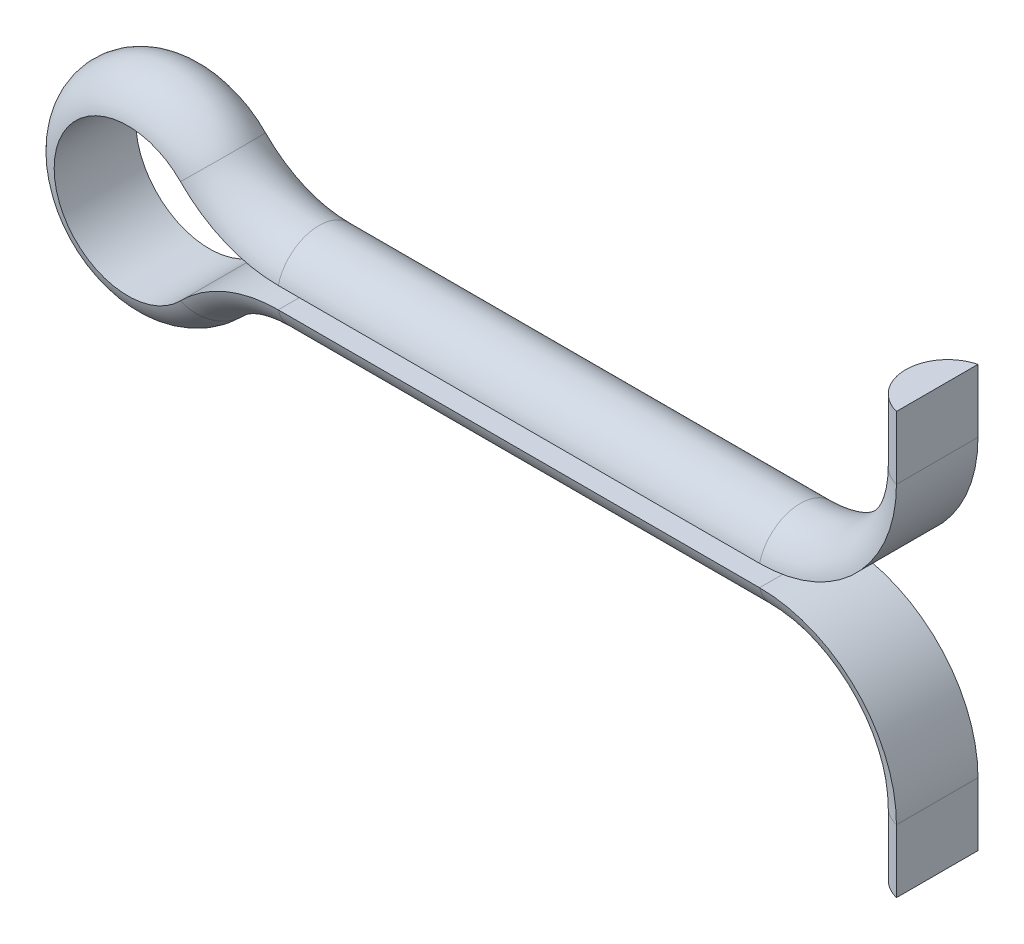
ISO-10303-21;
HEADER;
FILE_DESCRIPTION(('STEP AP214'),'2;1');
FILE_NAME('part.step','',(''),(''),'','','');
FILE_SCHEMA(('AUTOMOTIVE_DESIGN { 1 0 10303 214 1 1 1 1 }'));
ENDSEC;
DATA;
#1=APPLICATION_CONTEXT('core data for automotive mechanical design processes');
#2=APPLICATION_PROTOCOL_DEFINITION('international standard','automotive_design',2000,#1);
#3=PRODUCT_CONTEXT('',#1,'mechanical');
#4=PRODUCT('Part','Part','',(#3));
#5=PRODUCT_RELATED_PRODUCT_CATEGORY('part','',(#4));
#6=PRODUCT_DEFINITION_FORMATION('','',#4);
#7=PRODUCT_DEFINITION_CONTEXT('part definition',#1,'design');
#8=PRODUCT_DEFINITION('design','',#6,#7);
#9=PRODUCT_DEFINITION_SHAPE('','',#8);
#10=(LENGTH_UNIT() NAMED_UNIT(*) SI_UNIT(.MILLI.,.METRE.));
#11=(NAMED_UNIT(*) PLANE_ANGLE_UNIT() SI_UNIT($,.RADIAN.));
#12=(NAMED_UNIT(*) SI_UNIT($,.STERADIAN.) SOLID_ANGLE_UNIT());
#13=UNCERTAINTY_MEASURE_WITH_UNIT(LENGTH_MEASURE(1.E-05),#10,'distance_accuracy_value','');
#14=(GEOMETRIC_REPRESENTATION_CONTEXT(3) GLOBAL_UNCERTAINTY_ASSIGNED_CONTEXT((#13)) GLOBAL_UNIT_ASSIGNED_CONTEXT((#10,
#11,#12)) REPRESENTATION_CONTEXT('',''));
#15=CARTESIAN_POINT('',(0.,0.,0.));
#16=DIRECTION('',(0.,0.,1.));
#17=DIRECTION('',(1.,0.,0.));
#18=AXIS2_PLACEMENT_3D('',#15,#16,#17);
#19=CARTESIAN_POINT('',(37.,10.,0.));
#20=DIRECTION('',(0.,-1.,0.));
#21=DIRECTION('',(0.,0.,-1.));
#22=AXIS2_PLACEMENT_3D('',#19,#20,#21);
#23=PLANE('',#22);
#24=CARTESIAN_POINT('',(37.,10.,0.));
#25=DIRECTION('',(0.,-1.,0.));
#26=DIRECTION('',(0.,0.,-1.));
#27=AXIS2_PLACEMENT_3D('',#24,#25,#26);
#28=CIRCLE('',#27,2.);
#29=CARTESIAN_POINT('',(36.5,10.,1.93649167310371));
#30=VERTEX_POINT('',#29);
#31=CARTESIAN_POINT('',(36.5,10.,-1.93649167310371));
#32=VERTEX_POINT('',#31);
#33=EDGE_CURVE('E105',#30,#32,#28,.T.);
#34=ORIENTED_EDGE('',*,*,#33,.F.);
#35=DIRECTION('',(0.,0.,1.));
#36=VECTOR('',#35,1.);
#37=CARTESIAN_POINT('',(36.5,10.,-1.93649167310371));
#38=LINE('',#37,#36);
#39=EDGE_CURVE('E107',#32,#30,#38,.T.);
#40=ORIENTED_EDGE('',*,*,#39,.F.);
#41=EDGE_LOOP('',(#34,#40));
#42=FACE_BOUND('',#41,.T.);
#43=ADVANCED_FACE('F35',(#42),#23,.F.);
#44=CARTESIAN_POINT('',(37.,-9.99999999999991,0.));
#45=DIRECTION('',(0.,-1.,0.));
#46=DIRECTION('',(0.,0.,-1.));
#47=AXIS2_PLACEMENT_3D('',#44,#45,#46);
#48=PLANE('',#47);
#49=CARTESIAN_POINT('',(37.,-9.99999999999991,0.));
#50=DIRECTION('',(0.,-1.,0.));
#51=DIRECTION('',(0.,0.,-1.));
#52=AXIS2_PLACEMENT_3D('',#49,#50,#51);
#53=CIRCLE('',#52,2.);
#54=CARTESIAN_POINT('',(36.5,-9.99999999999991,1.93649167310371));
#55=VERTEX_POINT('',#54);
#56=CARTESIAN_POINT('',(36.5,-9.99999999999991,-1.93649167310371));
#57=VERTEX_POINT('',#56);
#58=EDGE_CURVE('E47',#55,#57,#53,.T.);
#59=ORIENTED_EDGE('',*,*,#58,.T.);
#60=DIRECTION('',(0.,0.,1.));
#61=VECTOR('',#60,1.);
#62=CARTESIAN_POINT('',(36.5,-9.99999999999991,-1.93649167310371));
#63=LINE('',#62,#61);
#64=EDGE_CURVE('E11',#57,#55,#63,.T.);
#65=ORIENTED_EDGE('',*,*,#64,.T.);
#66=EDGE_LOOP('',(#59,#65));
#67=FACE_BOUND('',#66,.T.);
#68=ADVANCED_FACE('F283',(#67),#48,.T.);
#69=CARTESIAN_POINT('',(37.,10.,0.));
#70=DIRECTION('',(0.,-1.,0.));
#71=DIRECTION('',(0.,0.,-1.));
#72=AXIS2_PLACEMENT_3D('',#69,#70,#71);
#73=CYLINDRICAL_SURFACE('',#72,2.);
#74=DIRECTION('',(0.,-1.,0.));
#75=VECTOR('',#74,1.);
#76=CARTESIAN_POINT('',(36.5,10.,-1.93649167310371));
#77=LINE('',#76,#75);
#78=CARTESIAN_POINT('',(36.5,7.00000000000001,-1.93649167310371));
#79=VERTEX_POINT('',#78);
#80=EDGE_CURVE('E118',#32,#79,#77,.T.);
#81=ORIENTED_EDGE('',*,*,#80,.T.);
#82=CARTESIAN_POINT('',(37.,7.00000000000001,0.));
#83=DIRECTION('',(0.,-1.,0.));
#84=DIRECTION('',(0.,0.,-1.));
#85=AXIS2_PLACEMENT_3D('',#82,#83,#84);
#86=CIRCLE('',#85,2.);
#87=CARTESIAN_POINT('',(36.5,7.00000000000001,1.93649167310371));
#88=VERTEX_POINT('',#87);
#89=EDGE_CURVE('E123',#88,#79,#86,.T.);
#90=ORIENTED_EDGE('',*,*,#89,.F.);
#91=DIRECTION('',(0.,-1.,0.));
#92=VECTOR('',#91,1.);
#93=CARTESIAN_POINT('',(36.5,10.,1.93649167310371));
#94=LINE('',#93,#92);
#95=EDGE_CURVE('E117',#30,#88,#94,.T.);
#96=ORIENTED_EDGE('',*,*,#95,.F.);
#97=ORIENTED_EDGE('',*,*,#33,.T.);
#98=EDGE_LOOP('',(#81,#90,#96,#97));
#99=FACE_BOUND('',#98,.T.);
#100=ADVANCED_FACE('F121',(#99),#73,.T.);
#101=CARTESIAN_POINT('',(36.5,10.,-1.93649167310371));
#102=DIRECTION('',(1.,0.,0.));
#103=DIRECTION('',(0.,0.,-1.));
#104=AXIS2_PLACEMENT_3D('',#101,#102,#103);
#105=PLANE('',#104);
#106=DIRECTION('',(0.,0.,1.));
#107=VECTOR('',#106,1.);
#108=CARTESIAN_POINT('',(36.5,7.00000000000001,-1.93649167310371));
#109=LINE('',#108,#107);
#110=EDGE_CURVE('E138',#79,#88,#109,.T.);
#111=ORIENTED_EDGE('',*,*,#110,.F.);
#112=ORIENTED_EDGE('',*,*,#80,.F.);
#113=ORIENTED_EDGE('',*,*,#39,.T.);
#114=ORIENTED_EDGE('',*,*,#95,.T.);
#115=EDGE_LOOP('',(#111,#112,#113,#114));
#116=FACE_BOUND('',#115,.T.);
#117=ADVANCED_FACE('F116',(#116),#105,.T.);
#118=CARTESIAN_POINT('',(30.,7.,0.));
#119=DIRECTION('',(0.,0.,-1.));
#120=DIRECTION('',(-1.,0.,0.));
#121=AXIS2_PLACEMENT_3D('',#118,#119,#120);
#122=TOROIDAL_SURFACE('',#121,7.,2.);
#123=CARTESIAN_POINT('',(30.,7.,-1.93649167310371));
#124=DIRECTION('',(0.,0.,-1.));
#125=DIRECTION('',(1.,0.,0.));
#126=AXIS2_PLACEMENT_3D('',#123,#124,#125);
#127=CIRCLE('',#126,6.5);
#128=CARTESIAN_POINT('',(30.,0.500000000000002,-1.93649167310371));
#129=VERTEX_POINT('',#128);
#130=EDGE_CURVE('E131',#79,#129,#127,.T.);
#131=ORIENTED_EDGE('',*,*,#130,.T.);
#132=CARTESIAN_POINT('',(30.,0.,0.));
#133=DIRECTION('',(-1.,0.,0.));
#134=DIRECTION('',(0.,0.,-1.));
#135=AXIS2_PLACEMENT_3D('',#132,#133,#134);
#136=CIRCLE('',#135,2.);
#137=CARTESIAN_POINT('',(30.,0.500000000000002,1.93649167310371));
#138=VERTEX_POINT('',#137);
#139=EDGE_CURVE('E128',#138,#129,#136,.T.);
#140=ORIENTED_EDGE('',*,*,#139,.F.);
#141=CARTESIAN_POINT('',(30.,7.,1.93649167310371));
#142=DIRECTION('',(0.,0.,-1.));
#143=DIRECTION('',(1.,0.,0.));
#144=AXIS2_PLACEMENT_3D('',#141,#142,#143);
#145=CIRCLE('',#144,6.5);
#146=EDGE_CURVE('E132',#88,#138,#145,.T.);
#147=ORIENTED_EDGE('',*,*,#146,.F.);
#148=ORIENTED_EDGE('',*,*,#89,.T.);
#149=EDGE_LOOP('',(#131,#140,#147,#148));
#150=FACE_BOUND('',#149,.T.);
#151=ADVANCED_FACE('F262',(#150),#122,.T.);
#152=CARTESIAN_POINT('',(30.,7.,0.));
#153=DIRECTION('',(0.,0.,-1.));
#154=DIRECTION('',(-1.,0.,0.));
#155=AXIS2_PLACEMENT_3D('',#152,#153,#154);
#156=CYLINDRICAL_SURFACE('',#155,6.5);
#157=DIRECTION('',(0.,0.,1.));
#158=VECTOR('',#157,1.);
#159=CARTESIAN_POINT('',(30.,0.500000000000007,-1.93649167310371));
#160=LINE('',#159,#158);
#161=EDGE_CURVE('E135',#129,#138,#160,.T.);
#162=ORIENTED_EDGE('',*,*,#161,.F.);
#163=ORIENTED_EDGE('',*,*,#130,.F.);
#164=ORIENTED_EDGE('',*,*,#110,.T.);
#165=ORIENTED_EDGE('',*,*,#146,.T.);
#166=EDGE_LOOP('',(#162,#163,#164,#165));
#167=FACE_BOUND('',#166,.T.);
#168=ADVANCED_FACE('F263',(#167),#156,.T.);
#169=CARTESIAN_POINT('',(30.,0.,0.));
#170=DIRECTION('',(-1.,0.,0.));
#171=DIRECTION('',(0.,-1.,0.));
#172=AXIS2_PLACEMENT_3D('',#169,#170,#171);
#173=CYLINDRICAL_SURFACE('',#172,2.);
#174=DIRECTION('',(-1.,0.,0.));
#175=VECTOR('',#174,1.);
#176=CARTESIAN_POINT('',(30.,0.500000000000007,-1.93649167310371));
#177=LINE('',#176,#175);
#178=CARTESIAN_POINT('',(7.14142842854285,0.499999999999999,-1.93649167310371));
#179=VERTEX_POINT('',#178);
#180=EDGE_CURVE('E142',#129,#179,#177,.T.);
#181=ORIENTED_EDGE('',*,*,#180,.T.);
#182=CARTESIAN_POINT('',(7.14142842854285,0.,0.));
#183=DIRECTION('',(-1.,0.,0.));
#184=DIRECTION('',(0.,0.,-1.));
#185=AXIS2_PLACEMENT_3D('',#182,#183,#184);
#186=CIRCLE('',#185,2.);
#187=CARTESIAN_POINT('',(7.14142842854285,0.499999999999999,1.93649167310371));
#188=VERTEX_POINT('',#187);
#189=EDGE_CURVE('E139',#188,#179,#186,.T.);
#190=ORIENTED_EDGE('',*,*,#189,.F.);
#191=DIRECTION('',(-1.,0.,0.));
#192=VECTOR('',#191,1.);
#193=CARTESIAN_POINT('',(30.,0.500000000000007,1.93649167310371));
#194=LINE('',#193,#192);
#195=EDGE_CURVE('E143',#138,#188,#194,.T.);
#196=ORIENTED_EDGE('',*,*,#195,.F.);
#197=ORIENTED_EDGE('',*,*,#139,.T.);
#198=EDGE_LOOP('',(#181,#190,#196,#197));
#199=FACE_BOUND('',#198,.T.);
#200=ADVANCED_FACE('F256',(#199),#173,.T.);
#201=CARTESIAN_POINT('',(30.,0.500000000000007,-1.93649167310371));
#202=DIRECTION('',(0.,-1.,0.));
#203=DIRECTION('',(1.,0.,0.));
#204=AXIS2_PLACEMENT_3D('',#201,#202,#203);
#205=PLANE('',#204);
#206=DIRECTION('',(0.,0.,1.));
#207=VECTOR('',#206,1.);
#208=CARTESIAN_POINT('',(7.14142842854285,0.5,-1.93649167310371));
#209=LINE('',#208,#207);
#210=EDGE_CURVE('E146',#179,#188,#209,.T.);
#211=ORIENTED_EDGE('',*,*,#210,.F.);
#212=ORIENTED_EDGE('',*,*,#180,.F.);
#213=ORIENTED_EDGE('',*,*,#161,.T.);
#214=ORIENTED_EDGE('',*,*,#195,.T.);
#215=EDGE_LOOP('',(#211,#212,#213,#214));
#216=FACE_BOUND('',#215,.T.);
#217=ADVANCED_FACE('F257',(#216),#205,.T.);
#218=CARTESIAN_POINT('',(7.14142842854285,7.,0.));
#219=DIRECTION('',(0.,0.,-1.));
#220=DIRECTION('',(-1.,0.,0.));
#221=AXIS2_PLACEMENT_3D('',#218,#219,#220);
#222=TOROIDAL_SURFACE('',#221,7.,2.);
#223=CARTESIAN_POINT('',(7.14142842854285,7.,-1.93649167310371));
#224=DIRECTION('',(0.,0.,-1.));
#225=DIRECTION('',(0.,-1.,0.));
#226=AXIS2_PLACEMENT_3D('',#223,#224,#225);
#227=CIRCLE('',#226,6.5);
#228=CARTESIAN_POINT('',(2.49949994999,2.45,-1.93649167310371));
#229=VERTEX_POINT('',#228);
#230=EDGE_CURVE('E152',#179,#229,#227,.T.);
#231=ORIENTED_EDGE('',*,*,#230,.T.);
#232=CARTESIAN_POINT('',(2.14242852856286,2.1,0.));
#233=DIRECTION('',(-0.7,0.714142842854285,0.));
#234=DIRECTION('',(0.,0.,-1.));
#235=AXIS2_PLACEMENT_3D('',#232,#233,#234);
#236=CIRCLE('',#235,2.);
#237=CARTESIAN_POINT('',(2.49949994999,2.45,1.93649167310371));
#238=VERTEX_POINT('',#237);
#239=EDGE_CURVE('E149',#238,#229,#236,.T.);
#240=ORIENTED_EDGE('',*,*,#239,.F.);
#241=CARTESIAN_POINT('',(7.14142842854285,7.,1.93649167310371));
#242=DIRECTION('',(0.,0.,-1.));
#243=DIRECTION('',(0.,-1.,0.));
#244=AXIS2_PLACEMENT_3D('',#241,#242,#243);
#245=CIRCLE('',#244,6.5);
#246=EDGE_CURVE('E153',#188,#238,#245,.T.);
#247=ORIENTED_EDGE('',*,*,#246,.F.);
#248=ORIENTED_EDGE('',*,*,#189,.T.);
#249=EDGE_LOOP('',(#231,#240,#247,#248));
#250=FACE_BOUND('',#249,.T.);
#251=ADVANCED_FACE('F250',(#250),#222,.T.);
#252=CARTESIAN_POINT('',(7.14142842854285,7.,0.));
#253=DIRECTION('',(0.,0.,-1.));
#254=DIRECTION('',(-1.,0.,0.));
#255=AXIS2_PLACEMENT_3D('',#252,#253,#254);
#256=CYLINDRICAL_SURFACE('',#255,6.5);
#257=DIRECTION('',(0.,0.,1.));
#258=VECTOR('',#257,1.);
#259=CARTESIAN_POINT('',(2.49949994999,2.45,-1.93649167310371));
#260=LINE('',#259,#258);
#261=EDGE_CURVE('E156',#229,#238,#260,.T.);
#262=ORIENTED_EDGE('',*,*,#261,.F.);
#263=ORIENTED_EDGE('',*,*,#230,.F.);
#264=ORIENTED_EDGE('',*,*,#210,.T.);
#265=ORIENTED_EDGE('',*,*,#246,.T.);
#266=EDGE_LOOP('',(#262,#263,#264,#265));
#267=FACE_BOUND('',#266,.T.);
#268=ADVANCED_FACE('F251',(#267),#256,.T.);
#269=CARTESIAN_POINT('',(0.,0.,0.));
#270=DIRECTION('',(0.,0.,1.));
#271=DIRECTION('',(1.,0.,0.));
#272=AXIS2_PLACEMENT_3D('',#269,#270,#271);
#273=TOROIDAL_SURFACE('',#272,2.99999999999999,2.);
#274=CARTESIAN_POINT('',(0.,0.,-1.93649167310371));
#275=DIRECTION('',(0.,0.,1.));
#276=DIRECTION('',(0.714142842854286,0.699999999999999,0.));
#277=AXIS2_PLACEMENT_3D('',#274,#275,#276);
#278=CIRCLE('',#277,3.5);
#279=CARTESIAN_POINT('',(2.49949994998999,-2.45,-1.93649167310371));
#280=VERTEX_POINT('',#279);
#281=EDGE_CURVE('E162',#229,#280,#278,.T.);
#282=ORIENTED_EDGE('',*,*,#281,.T.);
#283=CARTESIAN_POINT('',(2.14242852856286,-2.1,0.));
#284=DIRECTION('',(0.7,0.714142842854285,0.));
#285=DIRECTION('',(0.,0.,-1.));
#286=AXIS2_PLACEMENT_3D('',#283,#284,#285);
#287=CIRCLE('',#286,2.);
#288=CARTESIAN_POINT('',(2.49949994998999,-2.45,1.93649167310371));
#289=VERTEX_POINT('',#288);
#290=EDGE_CURVE('E159',#289,#280,#287,.T.);
#291=ORIENTED_EDGE('',*,*,#290,.F.);
#292=CARTESIAN_POINT('',(0.,0.,1.93649167310371));
#293=DIRECTION('',(0.,0.,1.));
#294=DIRECTION('',(0.714142842854286,0.699999999999999,0.));
#295=AXIS2_PLACEMENT_3D('',#292,#293,#294);
#296=CIRCLE('',#295,3.5);
#297=EDGE_CURVE('E163',#238,#289,#296,.T.);
#298=ORIENTED_EDGE('',*,*,#297,.F.);
#299=ORIENTED_EDGE('',*,*,#239,.T.);
#300=EDGE_LOOP('',(#282,#291,#298,#299));
#301=FACE_BOUND('',#300,.T.);
#302=ADVANCED_FACE('F244',(#301),#273,.T.);
#303=CARTESIAN_POINT('',(0.,0.,0.));
#304=DIRECTION('',(0.,0.,1.));
#305=DIRECTION('',(1.,0.,0.));
#306=AXIS2_PLACEMENT_3D('',#303,#304,#305);
#307=CYLINDRICAL_SURFACE('',#306,3.5);
#308=DIRECTION('',(0.,0.,1.));
#309=VECTOR('',#308,1.);
#310=CARTESIAN_POINT('',(2.49949994999,-2.45,-1.93649167310371));
#311=LINE('',#310,#309);
#312=EDGE_CURVE('E166',#280,#289,#311,.T.);
#313=ORIENTED_EDGE('',*,*,#312,.F.);
#314=ORIENTED_EDGE('',*,*,#281,.F.);
#315=ORIENTED_EDGE('',*,*,#261,.T.);
#316=ORIENTED_EDGE('',*,*,#297,.T.);
#317=EDGE_LOOP('',(#313,#314,#315,#316));
#318=FACE_BOUND('',#317,.T.);
#319=ADVANCED_FACE('F245',(#318),#307,.F.);
#320=CARTESIAN_POINT('',(7.14142842854285,-7.,0.));
#321=DIRECTION('',(0.,0.,-1.));
#322=DIRECTION('',(-1.,0.,0.));
#323=AXIS2_PLACEMENT_3D('',#320,#321,#322);
#324=TOROIDAL_SURFACE('',#323,7.,2.);
#325=CARTESIAN_POINT('',(7.14142842854285,-7.,-1.93649167310371));
#326=DIRECTION('',(0.,0.,-1.));
#327=DIRECTION('',(-0.714142842854285,0.7,0.));
#328=AXIS2_PLACEMENT_3D('',#325,#326,#327);
#329=CIRCLE('',#328,6.5);
#330=CARTESIAN_POINT('',(7.14142842854285,-0.500000000000001,-1.93649167310371));
#331=VERTEX_POINT('',#330);
#332=EDGE_CURVE('E172',#280,#331,#329,.T.);
#333=ORIENTED_EDGE('',*,*,#332,.T.);
#334=CARTESIAN_POINT('',(7.14142842854285,0.,0.));
#335=DIRECTION('',(1.,0.,0.));
#336=DIRECTION('',(0.,0.,-1.));
#337=AXIS2_PLACEMENT_3D('',#334,#335,#336);
#338=CIRCLE('',#337,2.);
#339=CARTESIAN_POINT('',(7.14142842854285,-0.500000000000001,1.93649167310371));
#340=VERTEX_POINT('',#339);
#341=EDGE_CURVE('E169',#340,#331,#338,.T.);
#342=ORIENTED_EDGE('',*,*,#341,.F.);
#343=CARTESIAN_POINT('',(7.14142842854285,-7.,1.93649167310371));
#344=DIRECTION('',(0.,0.,-1.));
#345=DIRECTION('',(-0.714142842854285,0.7,0.));
#346=AXIS2_PLACEMENT_3D('',#343,#344,#345);
#347=CIRCLE('',#346,6.5);
#348=EDGE_CURVE('E173',#289,#340,#347,.T.);
#349=ORIENTED_EDGE('',*,*,#348,.F.);
#350=ORIENTED_EDGE('',*,*,#290,.T.);
#351=EDGE_LOOP('',(#333,#342,#349,#350));
#352=FACE_BOUND('',#351,.T.);
#353=ADVANCED_FACE('F238',(#352),#324,.T.);
#354=CARTESIAN_POINT('',(7.14142842854285,-7.,0.));
#355=DIRECTION('',(0.,0.,-1.));
#356=DIRECTION('',(-1.,0.,0.));
#357=AXIS2_PLACEMENT_3D('',#354,#355,#356);
#358=CYLINDRICAL_SURFACE('',#357,6.5);
#359=DIRECTION('',(0.,0.,1.));
#360=VECTOR('',#359,1.);
#361=CARTESIAN_POINT('',(7.14142842854285,-0.5,-1.93649167310371));
#362=LINE('',#361,#360);
#363=EDGE_CURVE('E176',#331,#340,#362,.T.);
#364=ORIENTED_EDGE('',*,*,#363,.F.);
#365=ORIENTED_EDGE('',*,*,#332,.F.);
#366=ORIENTED_EDGE('',*,*,#312,.T.);
#367=ORIENTED_EDGE('',*,*,#348,.T.);
#368=EDGE_LOOP('',(#364,#365,#366,#367));
#369=FACE_BOUND('',#368,.T.);
#370=ADVANCED_FACE('F239',(#369),#358,.T.);
#371=CARTESIAN_POINT('',(7.14142842854285,0.,0.));
#372=DIRECTION('',(1.,0.,0.));
#373=DIRECTION('',(0.,1.,0.));
#374=AXIS2_PLACEMENT_3D('',#371,#372,#373);
#375=CYLINDRICAL_SURFACE('',#374,2.);
#376=DIRECTION('',(1.,0.,0.));
#377=VECTOR('',#376,1.);
#378=CARTESIAN_POINT('',(7.14142842854285,-0.5,-1.93649167310371));
#379=LINE('',#378,#377);
#380=CARTESIAN_POINT('',(30.,-0.499999999999996,-1.93649167310371));
#381=VERTEX_POINT('',#380);
#382=EDGE_CURVE('E182',#331,#381,#379,.T.);
#383=ORIENTED_EDGE('',*,*,#382,.T.);
#384=CARTESIAN_POINT('',(30.,0.,0.));
#385=DIRECTION('',(1.,0.,0.));
#386=DIRECTION('',(0.,0.,-1.));
#387=AXIS2_PLACEMENT_3D('',#384,#385,#386);
#388=CIRCLE('',#387,2.);
#389=CARTESIAN_POINT('',(30.,-0.499999999999996,1.93649167310371));
#390=VERTEX_POINT('',#389);
#391=EDGE_CURVE('E179',#390,#381,#388,.T.);
#392=ORIENTED_EDGE('',*,*,#391,.F.);
#393=DIRECTION('',(1.,0.,0.));
#394=VECTOR('',#393,1.);
#395=CARTESIAN_POINT('',(7.14142842854285,-0.5,1.93649167310371));
#396=LINE('',#395,#394);
#397=EDGE_CURVE('E183',#340,#390,#396,.T.);
#398=ORIENTED_EDGE('',*,*,#397,.F.);
#399=ORIENTED_EDGE('',*,*,#341,.T.);
#400=EDGE_LOOP('',(#383,#392,#398,#399));
#401=FACE_BOUND('',#400,.T.);
#402=ADVANCED_FACE('F232',(#401),#375,.T.);
#403=CARTESIAN_POINT('',(7.14142842854285,-0.5,-1.93649167310371));
#404=DIRECTION('',(0.,1.,0.));
#405=DIRECTION('',(-1.,0.,0.));
#406=AXIS2_PLACEMENT_3D('',#403,#404,#405);
#407=PLANE('',#406);
#408=DIRECTION('',(0.,0.,1.));
#409=VECTOR('',#408,1.);
#410=CARTESIAN_POINT('',(30.,-0.499999999999994,-1.93649167310371));
#411=LINE('',#410,#409);
#412=EDGE_CURVE('E186',#381,#390,#411,.T.);
#413=ORIENTED_EDGE('',*,*,#412,.F.);
#414=ORIENTED_EDGE('',*,*,#382,.F.);
#415=ORIENTED_EDGE('',*,*,#363,.T.);
#416=ORIENTED_EDGE('',*,*,#397,.T.);
#417=EDGE_LOOP('',(#413,#414,#415,#416));
#418=FACE_BOUND('',#417,.T.);
#419=ADVANCED_FACE('F233',(#418),#407,.T.);
#420=CARTESIAN_POINT('',(30.,-7.00000000000001,0.));
#421=DIRECTION('',(0.,0.,-1.));
#422=DIRECTION('',(-1.,0.,0.));
#423=AXIS2_PLACEMENT_3D('',#420,#421,#422);
#424=TOROIDAL_SURFACE('',#423,7.00000000000001,2.);
#425=CARTESIAN_POINT('',(30.,-7.00000000000001,-1.93649167310371));
#426=DIRECTION('',(0.,0.,-1.));
#427=DIRECTION('',(0.,1.,0.));
#428=AXIS2_PLACEMENT_3D('',#425,#426,#427);
#429=CIRCLE('',#428,6.50000000000001);
#430=CARTESIAN_POINT('',(36.5,-7.00000000000001,-1.93649167310371));
#431=VERTEX_POINT('',#430);
#432=EDGE_CURVE('E192',#381,#431,#429,.T.);
#433=ORIENTED_EDGE('',*,*,#432,.T.);
#434=CARTESIAN_POINT('',(37.,-7.00000000000001,0.));
#435=DIRECTION('',(0.,-1.,0.));
#436=DIRECTION('',(0.,0.,-1.));
#437=AXIS2_PLACEMENT_3D('',#434,#435,#436);
#438=CIRCLE('',#437,2.);
#439=CARTESIAN_POINT('',(36.5,-7.00000000000001,1.93649167310371));
#440=VERTEX_POINT('',#439);
#441=EDGE_CURVE('E189',#440,#431,#438,.T.);
#442=ORIENTED_EDGE('',*,*,#441,.F.);
#443=CARTESIAN_POINT('',(30.,-7.00000000000001,1.93649167310371));
#444=DIRECTION('',(0.,0.,-1.));
#445=DIRECTION('',(0.,1.,0.));
#446=AXIS2_PLACEMENT_3D('',#443,#444,#445);
#447=CIRCLE('',#446,6.50000000000001);
#448=EDGE_CURVE('E193',#390,#440,#447,.T.);
#449=ORIENTED_EDGE('',*,*,#448,.F.);
#450=ORIENTED_EDGE('',*,*,#391,.T.);
#451=EDGE_LOOP('',(#433,#442,#449,#450));
#452=FACE_BOUND('',#451,.T.);
#453=ADVANCED_FACE('F225',(#452),#424,.T.);
#454=CARTESIAN_POINT('',(30.,-7.00000000000001,0.));
#455=DIRECTION('',(0.,0.,-1.));
#456=DIRECTION('',(-1.,0.,0.));
#457=AXIS2_PLACEMENT_3D('',#454,#455,#456);
#458=CYLINDRICAL_SURFACE('',#457,6.50000000000001);
#459=DIRECTION('',(0.,0.,1.));
#460=VECTOR('',#459,1.);
#461=CARTESIAN_POINT('',(36.5,-7.00000000000001,-1.93649167310371));
#462=LINE('',#461,#460);
#463=EDGE_CURVE('E196',#431,#440,#462,.T.);
#464=ORIENTED_EDGE('',*,*,#463,.F.);
#465=ORIENTED_EDGE('',*,*,#432,.F.);
#466=ORIENTED_EDGE('',*,*,#412,.T.);
#467=ORIENTED_EDGE('',*,*,#448,.T.);
#468=EDGE_LOOP('',(#464,#465,#466,#467));
#469=FACE_BOUND('',#468,.T.);
#470=ADVANCED_FACE('F227',(#469),#458,.T.);
#471=CARTESIAN_POINT('',(37.,-6.99999999999992,0.));
#472=DIRECTION('',(0.,-1.,0.));
#473=DIRECTION('',(1.,0.,0.));
#474=AXIS2_PLACEMENT_3D('',#471,#472,#473);
#475=CYLINDRICAL_SURFACE('',#474,2.);
#476=DIRECTION('',(0.,-1.,0.));
#477=VECTOR('',#476,1.);
#478=CARTESIAN_POINT('',(36.5,-6.99999999999992,-1.93649167310371));
#479=LINE('',#478,#477);
#480=EDGE_CURVE('E42',#431,#57,#479,.T.);
#481=ORIENTED_EDGE('',*,*,#480,.T.);
#482=ORIENTED_EDGE('',*,*,#58,.F.);
#483=DIRECTION('',(0.,-1.,0.));
#484=VECTOR('',#483,1.);
#485=CARTESIAN_POINT('',(36.5,-6.99999999999992,1.93649167310371));
#486=LINE('',#485,#484);
#487=EDGE_CURVE('E200',#440,#55,#486,.T.);
#488=ORIENTED_EDGE('',*,*,#487,.F.);
#489=ORIENTED_EDGE('',*,*,#441,.T.);
#490=EDGE_LOOP('',(#481,#482,#488,#489));
#491=FACE_BOUND('',#490,.T.);
#492=ADVANCED_FACE('F275',(#491),#475,.T.);
#493=CARTESIAN_POINT('',(36.5,-6.99999999999992,-1.93649167310371));
#494=DIRECTION('',(1.,0.,0.));
#495=DIRECTION('',(0.,1.,0.));
#496=AXIS2_PLACEMENT_3D('',#493,#494,#495);
#497=PLANE('',#496);
#498=ORIENTED_EDGE('',*,*,#64,.F.);
#499=ORIENTED_EDGE('',*,*,#480,.F.);
#500=ORIENTED_EDGE('',*,*,#463,.T.);
#501=ORIENTED_EDGE('',*,*,#487,.T.);
#502=EDGE_LOOP('',(#498,#499,#500,#501));
#503=FACE_BOUND('',#502,.T.);
#504=ADVANCED_FACE('F222',(#503),#497,.T.);
#505=CLOSED_SHELL('',(#43,#68,#100,#117,#151,#168,#200,#217,#251,#268,#302,#319,#353,#370,#402,
#419,#453,#470,#492,#504));
#506=MANIFOLD_SOLID_BREP('B2',#505);
#507=ADVANCED_BREP_SHAPE_REPRESENTATION('',(#18,#506),#14);
#508=SHAPE_DEFINITION_REPRESENTATION(#9,#507);
ENDSEC;
END-ISO-10303-21;
